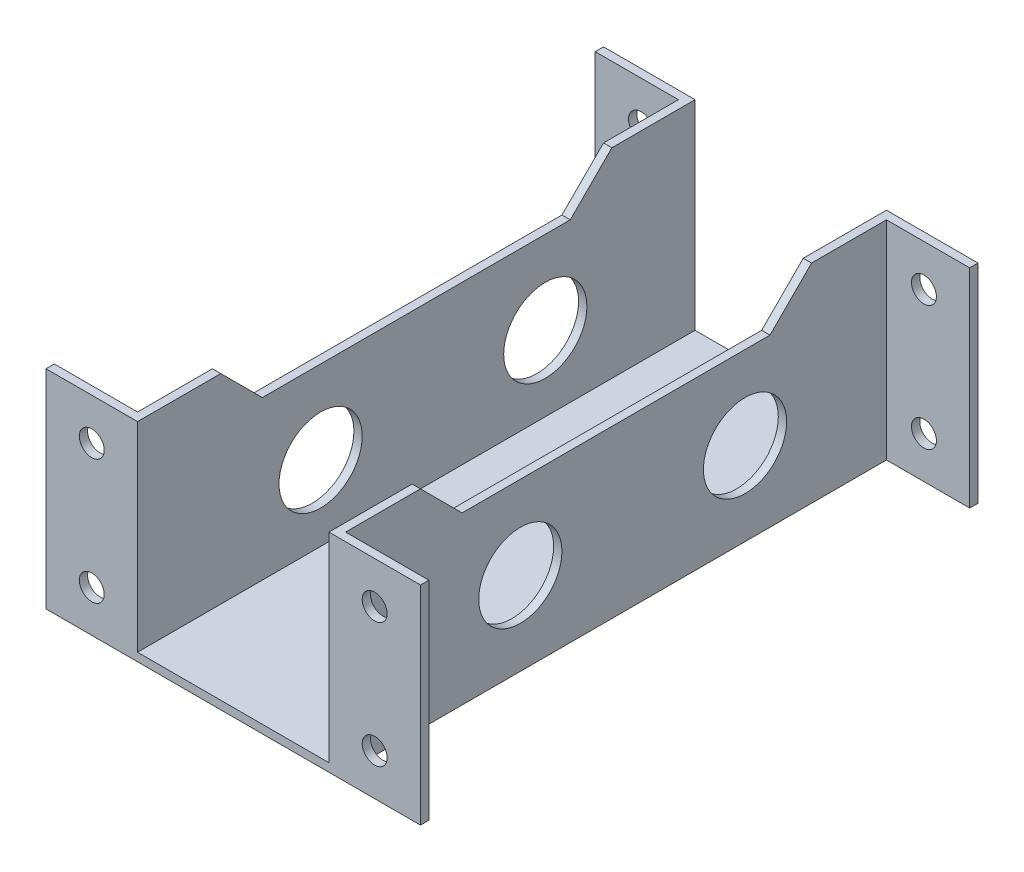
ISO-10303-21;
HEADER;
FILE_DESCRIPTION(('STEP AP214'),'2;1');
FILE_NAME('part.step','',(''),(''),'','','');
FILE_SCHEMA(('AUTOMOTIVE_DESIGN { 1 0 10303 214 1 1 1 1 }'));
ENDSEC;
DATA;
#1=APPLICATION_CONTEXT('core data for automotive mechanical design processes');
#2=APPLICATION_PROTOCOL_DEFINITION('international standard','automotive_design',2000,#1);
#3=PRODUCT_CONTEXT('',#1,'mechanical');
#4=PRODUCT('Part','Part','',(#3));
#5=PRODUCT_RELATED_PRODUCT_CATEGORY('part','',(#4));
#6=PRODUCT_DEFINITION_FORMATION('','',#4);
#7=PRODUCT_DEFINITION_CONTEXT('part definition',#1,'design');
#8=PRODUCT_DEFINITION('design','',#6,#7);
#9=PRODUCT_DEFINITION_SHAPE('','',#8);
#10=(LENGTH_UNIT() NAMED_UNIT(*) SI_UNIT(.MILLI.,.METRE.));
#11=(NAMED_UNIT(*) PLANE_ANGLE_UNIT() SI_UNIT($,.RADIAN.));
#12=(NAMED_UNIT(*) SI_UNIT($,.STERADIAN.) SOLID_ANGLE_UNIT());
#13=UNCERTAINTY_MEASURE_WITH_UNIT(LENGTH_MEASURE(1.E-05),#10,'distance_accuracy_value','');
#14=(GEOMETRIC_REPRESENTATION_CONTEXT(3) GLOBAL_UNCERTAINTY_ASSIGNED_CONTEXT((#13)) GLOBAL_UNIT_ASSIGNED_CONTEXT((#10,
#11,#12)) REPRESENTATION_CONTEXT('',''));
#15=CARTESIAN_POINT('',(0.,0.,0.));
#16=DIRECTION('',(0.,0.,1.));
#17=DIRECTION('',(1.,0.,0.));
#18=AXIS2_PLACEMENT_3D('',#15,#16,#17);
#19=CARTESIAN_POINT('',(0.,25.,0.));
#20=DIRECTION('',(0.,-1.,0.));
#21=DIRECTION('',(0.,0.,-1.));
#22=AXIS2_PLACEMENT_3D('',#19,#20,#21);
#23=PLANE('',#22);
#24=DIRECTION('',(0.,0.,-1.));
#25=VECTOR('',#24,1.);
#26=CARTESIAN_POINT('',(12.5,25.,-33.5));
#27=LINE('',#26,#25);
#28=CARTESIAN_POINT('',(12.5,25.,32.5));
#29=VERTEX_POINT('',#28);
#30=CARTESIAN_POINT('',(12.5,25.,23.5));
#31=VERTEX_POINT('',#30);
#32=EDGE_CURVE('E251',#29,#31,#27,.T.);
#33=ORIENTED_EDGE('',*,*,#32,.T.);
#34=DIRECTION('',(1.,0.,0.));
#35=VECTOR('',#34,1.);
#36=CARTESIAN_POINT('',(-22.500025,25.,23.5));
#37=LINE('',#36,#35);
#38=CARTESIAN_POINT('',(11.5,25.,23.5));
#39=VERTEX_POINT('',#38);
#40=EDGE_CURVE('E376',#39,#31,#37,.T.);
#41=ORIENTED_EDGE('',*,*,#40,.F.);
#42=DIRECTION('',(0.,0.,1.));
#43=VECTOR('',#42,1.);
#44=CARTESIAN_POINT('',(11.5,25.,-33.5));
#45=LINE('',#44,#43);
#46=CARTESIAN_POINT('',(11.5,25.,33.5));
#47=VERTEX_POINT('',#46);
#48=EDGE_CURVE('E492',#39,#47,#45,.T.);
#49=ORIENTED_EDGE('',*,*,#48,.T.);
#50=DIRECTION('',(1.,0.,0.));
#51=VECTOR('',#50,1.);
#52=CARTESIAN_POINT('',(12.5,25.,33.5));
#53=LINE('',#52,#51);
#54=CARTESIAN_POINT('',(22.5,25.,33.5));
#55=VERTEX_POINT('',#54);
#56=EDGE_CURVE('E360',#47,#55,#53,.T.);
#57=ORIENTED_EDGE('',*,*,#56,.T.);
#58=DIRECTION('',(0.,0.,1.));
#59=VECTOR('',#58,1.);
#60=CARTESIAN_POINT('',(22.5,25.,33.5));
#61=LINE('',#60,#59);
#62=CARTESIAN_POINT('',(22.5,25.,32.5));
#63=VERTEX_POINT('',#62);
#64=EDGE_CURVE('E278',#63,#55,#61,.T.);
#65=ORIENTED_EDGE('',*,*,#64,.F.);
#66=DIRECTION('',(-1.,0.,0.));
#67=VECTOR('',#66,1.);
#68=CARTESIAN_POINT('',(22.5,25.,32.5));
#69=LINE('',#68,#67);
#70=EDGE_CURVE('E274',#63,#29,#69,.T.);
#71=ORIENTED_EDGE('',*,*,#70,.T.);
#72=EDGE_LOOP('',(#33,#41,#49,#57,#65,#71));
#73=FACE_BOUND('',#72,.T.);
#74=ADVANCED_FACE('F35',(#73),#23,.F.);
#75=CARTESIAN_POINT('',(0.,25.,0.));
#76=DIRECTION('',(0.,1.,0.));
#77=DIRECTION('',(0.,0.,1.));
#78=AXIS2_PLACEMENT_3D('',#75,#76,#77);
#79=PLANE('',#78);
#80=DIRECTION('',(1.,0.,0.));
#81=VECTOR('',#80,1.);
#82=CARTESIAN_POINT('',(0.,25.,23.5));
#83=LINE('',#82,#81);
#84=CARTESIAN_POINT('',(-12.5,25.,23.5));
#85=VERTEX_POINT('',#84);
#86=CARTESIAN_POINT('',(-11.5,25.,23.5));
#87=VERTEX_POINT('',#86);
#88=EDGE_CURVE('E44',#85,#87,#83,.T.);
#89=ORIENTED_EDGE('',*,*,#88,.F.);
#90=DIRECTION('',(0.,0.,1.));
#91=VECTOR('',#90,1.);
#92=CARTESIAN_POINT('',(-12.5,25.,-33.5));
#93=LINE('',#92,#91);
#94=CARTESIAN_POINT('',(-12.5,25.,32.5));
#95=VERTEX_POINT('',#94);
#96=EDGE_CURVE('E223',#85,#95,#93,.T.);
#97=ORIENTED_EDGE('',*,*,#96,.T.);
#98=DIRECTION('',(1.,0.,0.));
#99=VECTOR('',#98,1.);
#100=CARTESIAN_POINT('',(-22.5,25.,32.5));
#101=LINE('',#100,#99);
#102=CARTESIAN_POINT('',(-22.5,25.,32.5));
#103=VERTEX_POINT('',#102);
#104=EDGE_CURVE('E318',#103,#95,#101,.T.);
#105=ORIENTED_EDGE('',*,*,#104,.F.);
#106=DIRECTION('',(0.,0.,-1.));
#107=VECTOR('',#106,1.);
#108=CARTESIAN_POINT('',(-22.5,25.,33.5));
#109=LINE('',#108,#107);
#110=CARTESIAN_POINT('',(-22.5,25.,33.5));
#111=VERTEX_POINT('',#110);
#112=EDGE_CURVE('E447',#111,#103,#109,.T.);
#113=ORIENTED_EDGE('',*,*,#112,.F.);
#114=DIRECTION('',(1.,0.,0.));
#115=VECTOR('',#114,1.);
#116=CARTESIAN_POINT('',(-12.5,25.,33.5));
#117=LINE('',#116,#115);
#118=CARTESIAN_POINT('',(-11.5,25.,33.5));
#119=VERTEX_POINT('',#118);
#120=EDGE_CURVE('E222',#111,#119,#117,.T.);
#121=ORIENTED_EDGE('',*,*,#120,.T.);
#122=DIRECTION('',(0.,0.,-1.));
#123=VECTOR('',#122,1.);
#124=CARTESIAN_POINT('',(-11.5,25.,-33.5));
#125=LINE('',#124,#123);
#126=EDGE_CURVE('E299',#119,#87,#125,.T.);
#127=ORIENTED_EDGE('',*,*,#126,.T.);
#128=EDGE_LOOP('',(#89,#97,#105,#113,#121,#127));
#129=FACE_BOUND('',#128,.T.);
#130=ADVANCED_FACE('F563',(#129),#79,.T.);
#131=CARTESIAN_POINT('',(-12.5,1.,33.5));
#132=DIRECTION('',(1.,0.,0.));
#133=DIRECTION('',(0.,0.,-1.));
#134=AXIS2_PLACEMENT_3D('',#131,#132,#133);
#135=PLANE('',#134);
#136=CARTESIAN_POINT('',(-12.5,10.,-15.5));
#137=DIRECTION('',(1.,0.,0.));
#138=DIRECTION('',(0.,0.,-1.));
#139=AXIS2_PLACEMENT_3D('',#136,#137,#138);
#140=CIRCLE('',#139,5.);
#141=CARTESIAN_POINT('',(-12.5,10.,-20.5));
#142=VERTEX_POINT('',#141);
#143=EDGE_CURVE('E539',#142,#142,#140,.T.);
#144=ORIENTED_EDGE('',*,*,#143,.T.);
#145=EDGE_LOOP('',(#144));
#146=FACE_BOUND('',#145,.T.);
#147=CARTESIAN_POINT('',(-12.5,10.,11.5));
#148=DIRECTION('',(1.,0.,0.));
#149=DIRECTION('',(0.,0.,-1.));
#150=AXIS2_PLACEMENT_3D('',#147,#148,#149);
#151=CIRCLE('',#150,5.);
#152=CARTESIAN_POINT('',(-12.5,10.,6.49999999999999));
#153=VERTEX_POINT('',#152);
#154=EDGE_CURVE('E521',#153,#153,#151,.T.);
#155=ORIENTED_EDGE('',*,*,#154,.T.);
#156=EDGE_LOOP('',(#155));
#157=FACE_BOUND('',#156,.T.);
#158=ORIENTED_EDGE('',*,*,#96,.F.);
#159=DIRECTION('',(0.,-0.707106781186549,-0.707106781186546));
#160=VECTOR('',#159,1.);
#161=CARTESIAN_POINT('',(-12.5,18.,16.5));
#162=LINE('',#161,#160);
#163=CARTESIAN_POINT('',(-12.5,20.,18.5));
#164=VERTEX_POINT('',#163);
#165=EDGE_CURVE('E386',#85,#164,#162,.T.);
#166=ORIENTED_EDGE('',*,*,#165,.T.);
#167=DIRECTION('',(0.,0.,-1.));
#168=VECTOR('',#167,1.);
#169=CARTESIAN_POINT('',(-12.5,20.,33.5));
#170=LINE('',#169,#168);
#171=CARTESIAN_POINT('',(-12.5,20.,-18.5));
#172=VERTEX_POINT('',#171);
#173=EDGE_CURVE('E214',#164,#172,#170,.T.);
#174=ORIENTED_EDGE('',*,*,#173,.T.);
#175=DIRECTION('',(0.,0.707106781186546,-0.707106781186549));
#176=VECTOR('',#175,1.);
#177=CARTESIAN_POINT('',(-12.5,-15.5,17.0000000000001));
#178=LINE('',#177,#176);
#179=CARTESIAN_POINT('',(-12.5,25.,-23.5));
#180=VERTEX_POINT('',#179);
#181=EDGE_CURVE('E200',#172,#180,#178,.T.);
#182=ORIENTED_EDGE('',*,*,#181,.T.);
#183=CARTESIAN_POINT('',(-12.5,25.,-32.5));
#184=VERTEX_POINT('',#183);
#185=EDGE_CURVE('E211',#184,#180,#93,.T.);
#186=ORIENTED_EDGE('',*,*,#185,.F.);
#187=DIRECTION('',(0.,1.,0.));
#188=VECTOR('',#187,1.);
#189=CARTESIAN_POINT('',(-12.5,25.,-32.5));
#190=LINE('',#189,#188);
#191=CARTESIAN_POINT('',(-12.5,0.,-32.5));
#192=VERTEX_POINT('',#191);
#193=EDGE_CURVE('E235',#192,#184,#190,.T.);
#194=ORIENTED_EDGE('',*,*,#193,.F.);
#195=DIRECTION('',(0.,0.,1.));
#196=VECTOR('',#195,1.);
#197=CARTESIAN_POINT('',(-12.5,0.,33.5));
#198=LINE('',#197,#196);
#199=CARTESIAN_POINT('',(-12.5,0.,32.5));
#200=VERTEX_POINT('',#199);
#201=EDGE_CURVE('E232',#192,#200,#198,.T.);
#202=ORIENTED_EDGE('',*,*,#201,.T.);
#203=DIRECTION('',(0.,-1.,0.));
#204=VECTOR('',#203,1.);
#205=CARTESIAN_POINT('',(-12.5,25.,32.5));
#206=LINE('',#205,#204);
#207=EDGE_CURVE('E448',#95,#200,#206,.T.);
#208=ORIENTED_EDGE('',*,*,#207,.F.);
#209=EDGE_LOOP('',(#158,#166,#174,#182,#186,#194,#202,#208));
#210=FACE_BOUND('',#209,.T.);
#211=ADVANCED_FACE('F210',(#146,#157,#210),#135,.F.);
#212=CARTESIAN_POINT('',(12.5,1.,33.5));
#213=DIRECTION('',(-1.,0.,0.));
#214=DIRECTION('',(0.,0.,1.));
#215=AXIS2_PLACEMENT_3D('',#212,#213,#214);
#216=PLANE('',#215);
#217=CARTESIAN_POINT('',(12.5,10.,-15.5));
#218=DIRECTION('',(1.,0.,0.));
#219=DIRECTION('',(0.,0.,-1.));
#220=AXIS2_PLACEMENT_3D('',#217,#218,#219);
#221=CIRCLE('',#220,5.);
#222=CARTESIAN_POINT('',(12.5,10.,-20.5));
#223=VERTEX_POINT('',#222);
#224=EDGE_CURVE('E545',#223,#223,#221,.T.);
#225=ORIENTED_EDGE('',*,*,#224,.F.);
#226=EDGE_LOOP('',(#225));
#227=FACE_BOUND('',#226,.T.);
#228=CARTESIAN_POINT('',(12.5,10.,11.5));
#229=DIRECTION('',(1.,0.,0.));
#230=DIRECTION('',(0.,0.,-1.));
#231=AXIS2_PLACEMENT_3D('',#228,#229,#230);
#232=CIRCLE('',#231,5.);
#233=CARTESIAN_POINT('',(12.5,10.,6.49999999999999));
#234=VERTEX_POINT('',#233);
#235=EDGE_CURVE('E535',#234,#234,#232,.T.);
#236=ORIENTED_EDGE('',*,*,#235,.F.);
#237=EDGE_LOOP('',(#236));
#238=FACE_BOUND('',#237,.T.);
#239=DIRECTION('',(0.,0.,1.));
#240=VECTOR('',#239,1.);
#241=CARTESIAN_POINT('',(12.5,20.,33.5));
#242=LINE('',#241,#240);
#243=CARTESIAN_POINT('',(12.5,20.,-18.5));
#244=VERTEX_POINT('',#243);
#245=CARTESIAN_POINT('',(12.5,20.,18.5));
#246=VERTEX_POINT('',#245);
#247=EDGE_CURVE('E382',#244,#246,#242,.T.);
#248=ORIENTED_EDGE('',*,*,#247,.T.);
#249=DIRECTION('',(0.,0.707106781186549,0.707106781186546));
#250=VECTOR('',#249,1.);
#251=CARTESIAN_POINT('',(12.5,18.,16.5));
#252=LINE('',#251,#250);
#253=EDGE_CURVE('E381',#246,#31,#252,.T.);
#254=ORIENTED_EDGE('',*,*,#253,.T.);
#255=ORIENTED_EDGE('',*,*,#32,.F.);
#256=DIRECTION('',(0.,1.,0.));
#257=VECTOR('',#256,1.);
#258=CARTESIAN_POINT('',(12.5,25.,32.5));
#259=LINE('',#258,#257);
#260=CARTESIAN_POINT('',(12.5,0.,32.5));
#261=VERTEX_POINT('',#260);
#262=EDGE_CURVE('E269',#261,#29,#259,.T.);
#263=ORIENTED_EDGE('',*,*,#262,.F.);
#264=DIRECTION('',(0.,0.,-1.));
#265=VECTOR('',#264,1.);
#266=CARTESIAN_POINT('',(12.5,0.,33.5));
#267=LINE('',#266,#265);
#268=CARTESIAN_POINT('',(12.5,0.,-32.5));
#269=VERTEX_POINT('',#268);
#270=EDGE_CURVE('E266',#261,#269,#267,.T.);
#271=ORIENTED_EDGE('',*,*,#270,.T.);
#272=DIRECTION('',(0.,-1.,0.));
#273=VECTOR('',#272,1.);
#274=CARTESIAN_POINT('',(12.5,25.,-32.5));
#275=LINE('',#274,#273);
#276=CARTESIAN_POINT('',(12.5,25.,-32.5));
#277=VERTEX_POINT('',#276);
#278=EDGE_CURVE('E330',#277,#269,#275,.T.);
#279=ORIENTED_EDGE('',*,*,#278,.F.);
#280=CARTESIAN_POINT('',(12.5,25.,-23.5));
#281=VERTEX_POINT('',#280);
#282=EDGE_CURVE('E249',#281,#277,#27,.T.);
#283=ORIENTED_EDGE('',*,*,#282,.F.);
#284=DIRECTION('',(0.,-0.707106781186546,0.707106781186549));
#285=VECTOR('',#284,1.);
#286=CARTESIAN_POINT('',(12.5,-15.5,17.0000000000001));
#287=LINE('',#286,#285);
#288=EDGE_CURVE('E52',#281,#244,#287,.T.);
#289=ORIENTED_EDGE('',*,*,#288,.T.);
#290=EDGE_LOOP('',(#248,#254,#255,#263,#271,#279,#283,#289));
#291=FACE_BOUND('',#290,.T.);
#292=ADVANCED_FACE('F37',(#227,#238,#291),#216,.F.);
#293=CARTESIAN_POINT('',(0.,1.,0.));
#294=DIRECTION('',(0.,-1.,0.));
#295=DIRECTION('',(0.,0.,-1.));
#296=AXIS2_PLACEMENT_3D('',#293,#294,#295);
#297=PLANE('',#296);
#298=CARTESIAN_POINT('',(0.,1.,-15.5));
#299=DIRECTION('',(0.,1.,0.));
#300=DIRECTION('',(0.,0.,1.));
#301=AXIS2_PLACEMENT_3D('',#298,#299,#300);
#302=CIRCLE('',#301,5.);
#303=CARTESIAN_POINT('',(0.,1.,-10.5));
#304=VERTEX_POINT('',#303);
#305=EDGE_CURVE('E438',#304,#304,#302,.T.);
#306=ORIENTED_EDGE('',*,*,#305,.F.);
#307=EDGE_LOOP('',(#306));
#308=FACE_BOUND('',#307,.T.);
#309=CARTESIAN_POINT('',(0.,1.,11.5));
#310=DIRECTION('',(0.,1.,0.));
#311=DIRECTION('',(0.,0.,1.));
#312=AXIS2_PLACEMENT_3D('',#309,#310,#311);
#313=CIRCLE('',#312,5.);
#314=CARTESIAN_POINT('',(0.,1.,16.5));
#315=VERTEX_POINT('',#314);
#316=EDGE_CURVE('E442',#315,#315,#313,.T.);
#317=ORIENTED_EDGE('',*,*,#316,.F.);
#318=EDGE_LOOP('',(#317));
#319=FACE_BOUND('',#318,.T.);
#320=DIRECTION('',(0.,0.,-1.));
#321=VECTOR('',#320,1.);
#322=CARTESIAN_POINT('',(-11.5,1.,-33.5));
#323=LINE('',#322,#321);
#324=CARTESIAN_POINT('',(-11.5,1.,33.5));
#325=VERTEX_POINT('',#324);
#326=CARTESIAN_POINT('',(-11.5,1.,-33.5));
#327=VERTEX_POINT('',#326);
#328=EDGE_CURVE('E227',#325,#327,#323,.T.);
#329=ORIENTED_EDGE('',*,*,#328,.F.);
#330=DIRECTION('',(1.,0.,0.));
#331=VECTOR('',#330,1.);
#332=CARTESIAN_POINT('',(-12.5,1.,33.5));
#333=LINE('',#332,#331);
#334=CARTESIAN_POINT('',(11.5,1.,33.5));
#335=VERTEX_POINT('',#334);
#336=EDGE_CURVE('E205',#325,#335,#333,.T.);
#337=ORIENTED_EDGE('',*,*,#336,.T.);
#338=DIRECTION('',(0.,0.,1.));
#339=VECTOR('',#338,1.);
#340=CARTESIAN_POINT('',(11.5,1.,-33.5));
#341=LINE('',#340,#339);
#342=CARTESIAN_POINT('',(11.5,1.,-33.5));
#343=VERTEX_POINT('',#342);
#344=EDGE_CURVE('E252',#343,#335,#341,.T.);
#345=ORIENTED_EDGE('',*,*,#344,.F.);
#346=DIRECTION('',(-1.,0.,0.));
#347=VECTOR('',#346,1.);
#348=CARTESIAN_POINT('',(-12.5,1.,-33.5));
#349=LINE('',#348,#347);
#350=EDGE_CURVE('E369',#343,#327,#349,.T.);
#351=ORIENTED_EDGE('',*,*,#350,.T.);
#352=EDGE_LOOP('',(#329,#337,#345,#351));
#353=FACE_BOUND('',#352,.T.);
#354=ADVANCED_FACE('F569',(#308,#319,#353),#297,.F.);
#355=CARTESIAN_POINT('',(-12.5,1.,-33.5));
#356=DIRECTION('',(0.,0.,1.));
#357=DIRECTION('',(1.,0.,0.));
#358=AXIS2_PLACEMENT_3D('',#355,#356,#357);
#359=PLANE('',#358);
#360=CARTESIAN_POINT('',(17.,20.,-33.5));
#361=DIRECTION('',(0.,0.,1.));
#362=DIRECTION('',(1.,0.,0.));
#363=AXIS2_PLACEMENT_3D('',#360,#361,#362);
#364=CIRCLE('',#363,1.5);
#365=CARTESIAN_POINT('',(18.5,20.,-33.5));
#366=VERTEX_POINT('',#365);
#367=EDGE_CURVE('E405',#366,#366,#364,.T.);
#368=ORIENTED_EDGE('',*,*,#367,.T.);
#369=EDGE_LOOP('',(#368));
#370=FACE_BOUND('',#369,.T.);
#371=CARTESIAN_POINT('',(17.,5.,-33.5));
#372=DIRECTION('',(0.,0.,1.));
#373=DIRECTION('',(1.,0.,0.));
#374=AXIS2_PLACEMENT_3D('',#371,#372,#373);
#375=CIRCLE('',#374,1.5);
#376=CARTESIAN_POINT('',(18.5,5.,-33.5));
#377=VERTEX_POINT('',#376);
#378=EDGE_CURVE('E415',#377,#377,#375,.T.);
#379=ORIENTED_EDGE('',*,*,#378,.T.);
#380=EDGE_LOOP('',(#379));
#381=FACE_BOUND('',#380,.T.);
#382=CARTESIAN_POINT('',(-17.,20.,-33.5));
#383=DIRECTION('',(0.,0.,1.));
#384=DIRECTION('',(1.,0.,0.));
#385=AXIS2_PLACEMENT_3D('',#382,#383,#384);
#386=CIRCLE('',#385,1.5);
#387=CARTESIAN_POINT('',(-15.5,20.,-33.5));
#388=VERTEX_POINT('',#387);
#389=EDGE_CURVE('E425',#388,#388,#386,.T.);
#390=ORIENTED_EDGE('',*,*,#389,.T.);
#391=EDGE_LOOP('',(#390));
#392=FACE_BOUND('',#391,.T.);
#393=CARTESIAN_POINT('',(-17.,5.,-33.5));
#394=DIRECTION('',(0.,0.,1.));
#395=DIRECTION('',(1.,0.,0.));
#396=AXIS2_PLACEMENT_3D('',#393,#394,#395);
#397=CIRCLE('',#396,1.5);
#398=CARTESIAN_POINT('',(-15.5,5.,-33.5));
#399=VERTEX_POINT('',#398);
#400=EDGE_CURVE('E435',#399,#399,#397,.T.);
#401=ORIENTED_EDGE('',*,*,#400,.T.);
#402=EDGE_LOOP('',(#401));
#403=FACE_BOUND('',#402,.T.);
#404=DIRECTION('',(-1.,0.,0.));
#405=VECTOR('',#404,1.);
#406=CARTESIAN_POINT('',(-12.5,0.,-33.5));
#407=LINE('',#406,#405);
#408=CARTESIAN_POINT('',(22.5,0.,-33.5));
#409=VERTEX_POINT('',#408);
#410=CARTESIAN_POINT('',(-22.5,0.,-33.5));
#411=VERTEX_POINT('',#410);
#412=EDGE_CURVE('E311',#409,#411,#407,.T.);
#413=ORIENTED_EDGE('',*,*,#412,.T.);
#414=DIRECTION('',(0.,-1.,0.));
#415=VECTOR('',#414,1.);
#416=CARTESIAN_POINT('',(-22.5,25.,-33.5));
#417=LINE('',#416,#415);
#418=CARTESIAN_POINT('',(-22.5,25.,-33.5));
#419=VERTEX_POINT('',#418);
#420=EDGE_CURVE('E309',#419,#411,#417,.T.);
#421=ORIENTED_EDGE('',*,*,#420,.F.);
#422=DIRECTION('',(-1.,0.,0.));
#423=VECTOR('',#422,1.);
#424=CARTESIAN_POINT('',(-12.5,25.,-33.5));
#425=LINE('',#424,#423);
#426=CARTESIAN_POINT('',(-11.5,25.,-33.5));
#427=VERTEX_POINT('',#426);
#428=EDGE_CURVE('E294',#427,#419,#425,.T.);
#429=ORIENTED_EDGE('',*,*,#428,.F.);
#430=DIRECTION('',(0.,-1.,0.));
#431=VECTOR('',#430,1.);
#432=CARTESIAN_POINT('',(-11.5,25.,-33.5));
#433=LINE('',#432,#431);
#434=EDGE_CURVE('E295',#427,#327,#433,.T.);
#435=ORIENTED_EDGE('',*,*,#434,.T.);
#436=ORIENTED_EDGE('',*,*,#350,.F.);
#437=DIRECTION('',(0.,-1.,0.));
#438=VECTOR('',#437,1.);
#439=CARTESIAN_POINT('',(11.5,25.,-33.5));
#440=LINE('',#439,#438);
#441=CARTESIAN_POINT('',(11.5,25.,-33.5));
#442=VERTEX_POINT('',#441);
#443=EDGE_CURVE('E469',#442,#343,#440,.T.);
#444=ORIENTED_EDGE('',*,*,#443,.F.);
#445=DIRECTION('',(-1.,0.,0.));
#446=VECTOR('',#445,1.);
#447=CARTESIAN_POINT('',(12.5,25.,-33.5));
#448=LINE('',#447,#446);
#449=CARTESIAN_POINT('',(22.5,25.,-33.5));
#450=VERTEX_POINT('',#449);
#451=EDGE_CURVE('E259',#450,#442,#448,.T.);
#452=ORIENTED_EDGE('',*,*,#451,.F.);
#453=DIRECTION('',(0.,1.,0.));
#454=VECTOR('',#453,1.);
#455=CARTESIAN_POINT('',(22.5,25.,-33.5));
#456=LINE('',#455,#454);
#457=EDGE_CURVE('E326',#409,#450,#456,.T.);
#458=ORIENTED_EDGE('',*,*,#457,.F.);
#459=EDGE_LOOP('',(#413,#421,#429,#435,#436,#444,#452,#458));
#460=FACE_BOUND('',#459,.T.);
#461=ADVANCED_FACE('F307',(#370,#381,#392,#403,#460),#359,.F.);
#462=CARTESIAN_POINT('',(-12.5,1.,33.5));
#463=DIRECTION('',(0.,0.,-1.));
#464=DIRECTION('',(-1.,0.,0.));
#465=AXIS2_PLACEMENT_3D('',#462,#463,#464);
#466=PLANE('',#465);
#467=CARTESIAN_POINT('',(17.,20.,33.5));
#468=DIRECTION('',(0.,0.,1.));
#469=DIRECTION('',(1.,0.,0.));
#470=AXIS2_PLACEMENT_3D('',#467,#468,#469);
#471=CIRCLE('',#470,1.5);
#472=CARTESIAN_POINT('',(18.5,20.,33.5));
#473=VERTEX_POINT('',#472);
#474=EDGE_CURVE('E399',#473,#473,#471,.T.);
#475=ORIENTED_EDGE('',*,*,#474,.F.);
#476=EDGE_LOOP('',(#475));
#477=FACE_BOUND('',#476,.T.);
#478=CARTESIAN_POINT('',(17.,5.,33.5));
#479=DIRECTION('',(0.,0.,1.));
#480=DIRECTION('',(1.,0.,0.));
#481=AXIS2_PLACEMENT_3D('',#478,#479,#480);
#482=CIRCLE('',#481,1.5);
#483=CARTESIAN_POINT('',(18.5,5.,33.5));
#484=VERTEX_POINT('',#483);
#485=EDGE_CURVE('E408',#484,#484,#482,.T.);
#486=ORIENTED_EDGE('',*,*,#485,.F.);
#487=EDGE_LOOP('',(#486));
#488=FACE_BOUND('',#487,.T.);
#489=CARTESIAN_POINT('',(-17.,20.,33.5));
#490=DIRECTION('',(0.,0.,1.));
#491=DIRECTION('',(1.,0.,0.));
#492=AXIS2_PLACEMENT_3D('',#489,#490,#491);
#493=CIRCLE('',#492,1.5);
#494=CARTESIAN_POINT('',(-15.5,20.,33.5));
#495=VERTEX_POINT('',#494);
#496=EDGE_CURVE('E418',#495,#495,#493,.T.);
#497=ORIENTED_EDGE('',*,*,#496,.F.);
#498=EDGE_LOOP('',(#497));
#499=FACE_BOUND('',#498,.T.);
#500=CARTESIAN_POINT('',(-17.,5.,33.5));
#501=DIRECTION('',(0.,0.,1.));
#502=DIRECTION('',(1.,0.,0.));
#503=AXIS2_PLACEMENT_3D('',#500,#501,#502);
#504=CIRCLE('',#503,1.5);
#505=CARTESIAN_POINT('',(-15.5,5.,33.5));
#506=VERTEX_POINT('',#505);
#507=EDGE_CURVE('E428',#506,#506,#504,.T.);
#508=ORIENTED_EDGE('',*,*,#507,.F.);
#509=EDGE_LOOP('',(#508));
#510=FACE_BOUND('',#509,.T.);
#511=DIRECTION('',(1.,0.,0.));
#512=VECTOR('',#511,1.);
#513=CARTESIAN_POINT('',(-12.5,0.,33.5));
#514=LINE('',#513,#512);
#515=CARTESIAN_POINT('',(-22.5,0.,33.5));
#516=VERTEX_POINT('',#515);
#517=CARTESIAN_POINT('',(22.5,0.,33.5));
#518=VERTEX_POINT('',#517);
#519=EDGE_CURVE('E362',#516,#518,#514,.T.);
#520=ORIENTED_EDGE('',*,*,#519,.T.);
#521=DIRECTION('',(0.,-1.,0.));
#522=VECTOR('',#521,1.);
#523=CARTESIAN_POINT('',(22.5,25.,33.5));
#524=LINE('',#523,#522);
#525=EDGE_CURVE('E272',#55,#518,#524,.T.);
#526=ORIENTED_EDGE('',*,*,#525,.F.);
#527=ORIENTED_EDGE('',*,*,#56,.F.);
#528=DIRECTION('',(0.,-1.,0.));
#529=VECTOR('',#528,1.);
#530=CARTESIAN_POINT('',(11.5,25.,33.5));
#531=LINE('',#530,#529);
#532=EDGE_CURVE('E487',#47,#335,#531,.T.);
#533=ORIENTED_EDGE('',*,*,#532,.T.);
#534=ORIENTED_EDGE('',*,*,#336,.F.);
#535=DIRECTION('',(0.,-1.,0.));
#536=VECTOR('',#535,1.);
#537=CARTESIAN_POINT('',(-11.5,25.,33.5));
#538=LINE('',#537,#536);
#539=EDGE_CURVE('E257',#119,#325,#538,.T.);
#540=ORIENTED_EDGE('',*,*,#539,.F.);
#541=ORIENTED_EDGE('',*,*,#120,.F.);
#542=DIRECTION('',(0.,1.,0.));
#543=VECTOR('',#542,1.);
#544=CARTESIAN_POINT('',(-22.5,25.,33.5));
#545=LINE('',#544,#543);
#546=EDGE_CURVE('E365',#516,#111,#545,.T.);
#547=ORIENTED_EDGE('',*,*,#546,.F.);
#548=EDGE_LOOP('',(#520,#526,#527,#533,#534,#540,#541,#547));
#549=FACE_BOUND('',#548,.T.);
#550=ADVANCED_FACE('F358',(#477,#488,#499,#510,#549),#466,.F.);
#551=CARTESIAN_POINT('',(0.,0.,0.));
#552=DIRECTION('',(0.,-1.,0.));
#553=DIRECTION('',(0.,0.,-1.));
#554=AXIS2_PLACEMENT_3D('',#551,#552,#553);
#555=PLANE('',#554);
#556=CARTESIAN_POINT('',(0.,0.,-15.5));
#557=DIRECTION('',(0.,-1.,0.));
#558=DIRECTION('',(0.,0.,-1.));
#559=AXIS2_PLACEMENT_3D('',#556,#557,#558);
#560=CIRCLE('',#559,5.);
#561=CARTESIAN_POINT('',(0.,0.,-20.5));
#562=VERTEX_POINT('',#561);
#563=EDGE_CURVE('E441',#562,#562,#560,.T.);
#564=ORIENTED_EDGE('',*,*,#563,.F.);
#565=EDGE_LOOP('',(#564));
#566=FACE_BOUND('',#565,.T.);
#567=CARTESIAN_POINT('',(0.,0.,11.5));
#568=DIRECTION('',(0.,-1.,0.));
#569=DIRECTION('',(0.,0.,-1.));
#570=AXIS2_PLACEMENT_3D('',#567,#568,#569);
#571=CIRCLE('',#570,5.);
#572=CARTESIAN_POINT('',(0.,0.,6.49999999999999));
#573=VERTEX_POINT('',#572);
#574=EDGE_CURVE('E445',#573,#573,#571,.T.);
#575=ORIENTED_EDGE('',*,*,#574,.F.);
#576=EDGE_LOOP('',(#575));
#577=FACE_BOUND('',#576,.T.);
#578=ORIENTED_EDGE('',*,*,#270,.F.);
#579=DIRECTION('',(-1.,0.,0.));
#580=VECTOR('',#579,1.);
#581=CARTESIAN_POINT('',(22.5,0.,32.5));
#582=LINE('',#581,#580);
#583=CARTESIAN_POINT('',(22.5,0.,32.5));
#584=VERTEX_POINT('',#583);
#585=EDGE_CURVE('E277',#584,#261,#582,.T.);
#586=ORIENTED_EDGE('',*,*,#585,.F.);
#587=DIRECTION('',(0.,0.,-1.));
#588=VECTOR('',#587,1.);
#589=CARTESIAN_POINT('',(22.5,0.,33.5));
#590=LINE('',#589,#588);
#591=EDGE_CURVE('E346',#518,#584,#590,.T.);
#592=ORIENTED_EDGE('',*,*,#591,.F.);
#593=ORIENTED_EDGE('',*,*,#519,.F.);
#594=DIRECTION('',(0.,0.,1.));
#595=VECTOR('',#594,1.);
#596=CARTESIAN_POINT('',(-22.5,0.,33.5));
#597=LINE('',#596,#595);
#598=CARTESIAN_POINT('',(-22.5,0.,32.5));
#599=VERTEX_POINT('',#598);
#600=EDGE_CURVE('E452',#599,#516,#597,.T.);
#601=ORIENTED_EDGE('',*,*,#600,.F.);
#602=DIRECTION('',(1.,0.,0.));
#603=VECTOR('',#602,1.);
#604=CARTESIAN_POINT('',(-22.5,0.,32.5));
#605=LINE('',#604,#603);
#606=EDGE_CURVE('E454',#599,#200,#605,.T.);
#607=ORIENTED_EDGE('',*,*,#606,.T.);
#608=ORIENTED_EDGE('',*,*,#201,.F.);
#609=DIRECTION('',(1.,0.,0.));
#610=VECTOR('',#609,1.);
#611=CARTESIAN_POINT('',(-22.5,0.,-32.5));
#612=LINE('',#611,#610);
#613=CARTESIAN_POINT('',(-22.5,0.,-32.5));
#614=VERTEX_POINT('',#613);
#615=EDGE_CURVE('E339',#614,#192,#612,.T.);
#616=ORIENTED_EDGE('',*,*,#615,.F.);
#617=DIRECTION('',(0.,0.,1.));
#618=VECTOR('',#617,1.);
#619=CARTESIAN_POINT('',(-22.5,0.,-33.5));
#620=LINE('',#619,#618);
#621=EDGE_CURVE('E314',#411,#614,#620,.T.);
#622=ORIENTED_EDGE('',*,*,#621,.F.);
#623=ORIENTED_EDGE('',*,*,#412,.F.);
#624=DIRECTION('',(0.,0.,-1.));
#625=VECTOR('',#624,1.);
#626=CARTESIAN_POINT('',(22.5,0.,-33.5));
#627=LINE('',#626,#625);
#628=CARTESIAN_POINT('',(22.5,0.,-32.5));
#629=VERTEX_POINT('',#628);
#630=EDGE_CURVE('E334',#629,#409,#627,.T.);
#631=ORIENTED_EDGE('',*,*,#630,.F.);
#632=DIRECTION('',(-1.,0.,0.));
#633=VECTOR('',#632,1.);
#634=CARTESIAN_POINT('',(22.5,0.,-32.5));
#635=LINE('',#634,#633);
#636=EDGE_CURVE('E337',#629,#269,#635,.T.);
#637=ORIENTED_EDGE('',*,*,#636,.T.);
#638=EDGE_LOOP('',(#578,#586,#592,#593,#601,#607,#608,#616,#622,#623,#631,#637));
#639=FACE_BOUND('',#638,.T.);
#640=ADVANCED_FACE('F372',(#566,#577,#639),#555,.T.);
#641=CARTESIAN_POINT('',(11.5,25.,-33.5));
#642=DIRECTION('',(1.,0.,0.));
#643=DIRECTION('',(0.,0.,-1.));
#644=AXIS2_PLACEMENT_3D('',#641,#642,#643);
#645=PLANE('',#644);
#646=CARTESIAN_POINT('',(11.5,10.,-15.5));
#647=DIRECTION('',(1.,0.,0.));
#648=DIRECTION('',(0.,0.,-1.));
#649=AXIS2_PLACEMENT_3D('',#646,#647,#648);
#650=CIRCLE('',#649,5.);
#651=CARTESIAN_POINT('',(11.5,10.,-20.5));
#652=VERTEX_POINT('',#651);
#653=EDGE_CURVE('E542',#652,#652,#650,.T.);
#654=ORIENTED_EDGE('',*,*,#653,.T.);
#655=EDGE_LOOP('',(#654));
#656=FACE_BOUND('',#655,.T.);
#657=CARTESIAN_POINT('',(11.5,10.,11.5));
#658=DIRECTION('',(1.,0.,0.));
#659=DIRECTION('',(0.,0.,-1.));
#660=AXIS2_PLACEMENT_3D('',#657,#658,#659);
#661=CIRCLE('',#660,5.);
#662=CARTESIAN_POINT('',(11.5,10.,6.49999999999999));
#663=VERTEX_POINT('',#662);
#664=EDGE_CURVE('E528',#663,#663,#661,.T.);
#665=ORIENTED_EDGE('',*,*,#664,.T.);
#666=EDGE_LOOP('',(#665));
#667=FACE_BOUND('',#666,.T.);
#668=ORIENTED_EDGE('',*,*,#48,.F.);
#669=DIRECTION('',(0.,-0.707106781186549,-0.707106781186546));
#670=VECTOR('',#669,1.);
#671=CARTESIAN_POINT('',(11.5,-3.50000000000001,-4.99999999999991));
#672=LINE('',#671,#670);
#673=CARTESIAN_POINT('',(11.5,20.,18.5));
#674=VERTEX_POINT('',#673);
#675=EDGE_CURVE('E387',#39,#674,#672,.T.);
#676=ORIENTED_EDGE('',*,*,#675,.T.);
#677=DIRECTION('',(0.,0.,-1.));
#678=VECTOR('',#677,1.);
#679=CARTESIAN_POINT('',(11.5,20.,-33.5));
#680=LINE('',#679,#678);
#681=CARTESIAN_POINT('',(11.5,20.,-18.5));
#682=VERTEX_POINT('',#681);
#683=EDGE_CURVE('E389',#674,#682,#680,.T.);
#684=ORIENTED_EDGE('',*,*,#683,.T.);
#685=DIRECTION('',(0.,0.707106781186546,-0.707106781186549));
#686=VECTOR('',#685,1.);
#687=CARTESIAN_POINT('',(11.5,30.,-28.5));
#688=LINE('',#687,#686);
#689=CARTESIAN_POINT('',(11.5,25.,-23.5));
#690=VERTEX_POINT('',#689);
#691=EDGE_CURVE('E503',#682,#690,#688,.T.);
#692=ORIENTED_EDGE('',*,*,#691,.T.);
#693=EDGE_CURVE('E490',#442,#690,#45,.T.);
#694=ORIENTED_EDGE('',*,*,#693,.F.);
#695=ORIENTED_EDGE('',*,*,#443,.T.);
#696=ORIENTED_EDGE('',*,*,#344,.T.);
#697=ORIENTED_EDGE('',*,*,#532,.F.);
#698=EDGE_LOOP('',(#668,#676,#684,#692,#694,#695,#696,#697));
#699=FACE_BOUND('',#698,.T.);
#700=ADVANCED_FACE('F502',(#656,#667,#699),#645,.F.);
#701=ORIENTED_EDGE('',*,*,#693,.T.);
#702=DIRECTION('',(1.,0.,0.));
#703=VECTOR('',#702,1.);
#704=CARTESIAN_POINT('',(-22.500025,25.,-23.5));
#705=LINE('',#704,#703);
#706=EDGE_CURVE('E524',#690,#281,#705,.T.);
#707=ORIENTED_EDGE('',*,*,#706,.T.);
#708=ORIENTED_EDGE('',*,*,#282,.T.);
#709=DIRECTION('',(-1.,0.,0.));
#710=VECTOR('',#709,1.);
#711=CARTESIAN_POINT('',(22.5,25.,-32.5));
#712=LINE('',#711,#710);
#713=CARTESIAN_POINT('',(22.5,25.,-32.5));
#714=VERTEX_POINT('',#713);
#715=EDGE_CURVE('E273',#714,#277,#712,.T.);
#716=ORIENTED_EDGE('',*,*,#715,.F.);
#717=DIRECTION('',(0.,0.,1.));
#718=VECTOR('',#717,1.);
#719=CARTESIAN_POINT('',(22.5,25.,-33.5));
#720=LINE('',#719,#718);
#721=EDGE_CURVE('E329',#450,#714,#720,.T.);
#722=ORIENTED_EDGE('',*,*,#721,.F.);
#723=ORIENTED_EDGE('',*,*,#451,.T.);
#724=EDGE_LOOP('',(#701,#707,#708,#716,#722,#723));
#725=FACE_BOUND('',#724,.T.);
#726=ADVANCED_FACE('F497',(#725),#23,.F.);
#727=CARTESIAN_POINT('',(-11.5,25.,-33.5));
#728=DIRECTION('',(-1.,0.,0.));
#729=DIRECTION('',(0.,0.,1.));
#730=AXIS2_PLACEMENT_3D('',#727,#728,#729);
#731=PLANE('',#730);
#732=CARTESIAN_POINT('',(-11.5,10.,-15.5));
#733=DIRECTION('',(-1.,0.,0.));
#734=DIRECTION('',(0.,0.,1.));
#735=AXIS2_PLACEMENT_3D('',#732,#733,#734);
#736=CIRCLE('',#735,5.);
#737=CARTESIAN_POINT('',(-11.5,10.,-10.5));
#738=VERTEX_POINT('',#737);
#739=EDGE_CURVE('E39',#738,#738,#736,.T.);
#740=ORIENTED_EDGE('',*,*,#739,.T.);
#741=EDGE_LOOP('',(#740));
#742=FACE_BOUND('',#741,.T.);
#743=CARTESIAN_POINT('',(-11.5,10.,11.5));
#744=DIRECTION('',(-1.,0.,0.));
#745=DIRECTION('',(0.,0.,1.));
#746=AXIS2_PLACEMENT_3D('',#743,#744,#745);
#747=CIRCLE('',#746,5.);
#748=CARTESIAN_POINT('',(-11.5,10.,16.5));
#749=VERTEX_POINT('',#748);
#750=EDGE_CURVE('E253',#749,#749,#747,.T.);
#751=ORIENTED_EDGE('',*,*,#750,.T.);
#752=EDGE_LOOP('',(#751));
#753=FACE_BOUND('',#752,.T.);
#754=DIRECTION('',(0.,0.,1.));
#755=VECTOR('',#754,1.);
#756=CARTESIAN_POINT('',(-11.5,20.,-33.5));
#757=LINE('',#756,#755);
#758=CARTESIAN_POINT('',(-11.5,20.,-18.5));
#759=VERTEX_POINT('',#758);
#760=CARTESIAN_POINT('',(-11.5,20.,18.5));
#761=VERTEX_POINT('',#760);
#762=EDGE_CURVE('E11',#759,#761,#757,.T.);
#763=ORIENTED_EDGE('',*,*,#762,.T.);
#764=DIRECTION('',(0.,0.707106781186549,0.707106781186546));
#765=VECTOR('',#764,1.);
#766=CARTESIAN_POINT('',(-11.5,-3.50000000000001,-4.99999999999991));
#767=LINE('',#766,#765);
#768=EDGE_CURVE('E215',#761,#87,#767,.T.);
#769=ORIENTED_EDGE('',*,*,#768,.T.);
#770=ORIENTED_EDGE('',*,*,#126,.F.);
#771=ORIENTED_EDGE('',*,*,#539,.T.);
#772=ORIENTED_EDGE('',*,*,#328,.T.);
#773=ORIENTED_EDGE('',*,*,#434,.F.);
#774=CARTESIAN_POINT('',(-11.5,25.,-23.5));
#775=VERTEX_POINT('',#774);
#776=EDGE_CURVE('E225',#775,#427,#125,.T.);
#777=ORIENTED_EDGE('',*,*,#776,.F.);
#778=DIRECTION('',(0.,-0.707106781186546,0.707106781186549));
#779=VECTOR('',#778,1.);
#780=CARTESIAN_POINT('',(-11.5,30.,-28.5));
#781=LINE('',#780,#779);
#782=EDGE_CURVE('E60',#775,#759,#781,.T.);
#783=ORIENTED_EDGE('',*,*,#782,.T.);
#784=EDGE_LOOP('',(#763,#769,#770,#771,#772,#773,#777,#783));
#785=FACE_BOUND('',#784,.T.);
#786=ADVANCED_FACE('F305',(#742,#753,#785),#731,.F.);
#787=DIRECTION('',(-1.,0.,0.));
#788=VECTOR('',#787,1.);
#789=CARTESIAN_POINT('',(0.,25.,-23.5));
#790=LINE('',#789,#788);
#791=EDGE_CURVE('E197',#775,#180,#790,.T.);
#792=ORIENTED_EDGE('',*,*,#791,.F.);
#793=ORIENTED_EDGE('',*,*,#776,.T.);
#794=ORIENTED_EDGE('',*,*,#428,.T.);
#795=DIRECTION('',(0.,0.,-1.));
#796=VECTOR('',#795,1.);
#797=CARTESIAN_POINT('',(-22.5,25.,-33.5));
#798=LINE('',#797,#796);
#799=CARTESIAN_POINT('',(-22.5,25.,-32.5));
#800=VERTEX_POINT('',#799);
#801=EDGE_CURVE('E323',#800,#419,#798,.T.);
#802=ORIENTED_EDGE('',*,*,#801,.F.);
#803=DIRECTION('',(1.,0.,0.));
#804=VECTOR('',#803,1.);
#805=CARTESIAN_POINT('',(-22.5,25.,-32.5));
#806=LINE('',#805,#804);
#807=EDGE_CURVE('E221',#800,#184,#806,.T.);
#808=ORIENTED_EDGE('',*,*,#807,.T.);
#809=ORIENTED_EDGE('',*,*,#185,.T.);
#810=EDGE_LOOP('',(#792,#793,#794,#802,#808,#809));
#811=FACE_BOUND('',#810,.T.);
#812=ADVANCED_FACE('F218',(#811),#79,.T.);
#813=CARTESIAN_POINT('',(22.5,25.,32.5));
#814=DIRECTION('',(0.,0.,1.));
#815=DIRECTION('',(1.,0.,0.));
#816=AXIS2_PLACEMENT_3D('',#813,#814,#815);
#817=PLANE('',#816);
#818=CARTESIAN_POINT('',(17.,20.,32.5));
#819=DIRECTION('',(0.,0.,1.));
#820=DIRECTION('',(1.,0.,0.));
#821=AXIS2_PLACEMENT_3D('',#818,#819,#820);
#822=CIRCLE('',#821,1.5);
#823=CARTESIAN_POINT('',(18.5,20.,32.5));
#824=VERTEX_POINT('',#823);
#825=EDGE_CURVE('E402',#824,#824,#822,.T.);
#826=ORIENTED_EDGE('',*,*,#825,.T.);
#827=EDGE_LOOP('',(#826));
#828=FACE_BOUND('',#827,.T.);
#829=CARTESIAN_POINT('',(17.,5.,32.5));
#830=DIRECTION('',(0.,0.,1.));
#831=DIRECTION('',(1.,0.,0.));
#832=AXIS2_PLACEMENT_3D('',#829,#830,#831);
#833=CIRCLE('',#832,1.5);
#834=CARTESIAN_POINT('',(18.5,5.,32.5));
#835=VERTEX_POINT('',#834);
#836=EDGE_CURVE('E412',#835,#835,#833,.T.);
#837=ORIENTED_EDGE('',*,*,#836,.T.);
#838=EDGE_LOOP('',(#837));
#839=FACE_BOUND('',#838,.T.);
#840=ORIENTED_EDGE('',*,*,#262,.T.);
#841=ORIENTED_EDGE('',*,*,#70,.F.);
#842=DIRECTION('',(0.,1.,0.));
#843=VECTOR('',#842,1.);
#844=CARTESIAN_POINT('',(22.5,25.,32.5));
#845=LINE('',#844,#843);
#846=EDGE_CURVE('E348',#584,#63,#845,.T.);
#847=ORIENTED_EDGE('',*,*,#846,.F.);
#848=ORIENTED_EDGE('',*,*,#585,.T.);
#849=EDGE_LOOP('',(#840,#841,#847,#848));
#850=FACE_BOUND('',#849,.T.);
#851=ADVANCED_FACE('F374',(#828,#839,#850),#817,.F.);
#852=CARTESIAN_POINT('',(22.5,0.,0.));
#853=DIRECTION('',(1.,0.,0.));
#854=DIRECTION('',(0.,0.,-1.));
#855=AXIS2_PLACEMENT_3D('',#852,#853,#854);
#856=PLANE('',#855);
#857=ORIENTED_EDGE('',*,*,#525,.T.);
#858=ORIENTED_EDGE('',*,*,#591,.T.);
#859=ORIENTED_EDGE('',*,*,#846,.T.);
#860=ORIENTED_EDGE('',*,*,#64,.T.);
#861=EDGE_LOOP('',(#857,#858,#859,#860));
#862=FACE_BOUND('',#861,.T.);
#863=ADVANCED_FACE('F353',(#862),#856,.T.);
#864=CARTESIAN_POINT('',(22.5,25.,-32.5));
#865=DIRECTION('',(0.,0.,-1.));
#866=DIRECTION('',(0.,1.,0.));
#867=AXIS2_PLACEMENT_3D('',#864,#865,#866);
#868=PLANE('',#867);
#869=CARTESIAN_POINT('',(17.,20.,-32.5));
#870=DIRECTION('',(0.,0.,-1.));
#871=DIRECTION('',(0.,1.,0.));
#872=AXIS2_PLACEMENT_3D('',#869,#870,#871);
#873=CIRCLE('',#872,1.5);
#874=CARTESIAN_POINT('',(17.,21.5,-32.5));
#875=VERTEX_POINT('',#874);
#876=EDGE_CURVE('E245',#875,#875,#873,.T.);
#877=ORIENTED_EDGE('',*,*,#876,.T.);
#878=EDGE_LOOP('',(#877));
#879=FACE_BOUND('',#878,.T.);
#880=CARTESIAN_POINT('',(17.,5.,-32.5));
#881=DIRECTION('',(0.,0.,-1.));
#882=DIRECTION('',(0.,1.,0.));
#883=AXIS2_PLACEMENT_3D('',#880,#881,#882);
#884=CIRCLE('',#883,1.5);
#885=CARTESIAN_POINT('',(17.,6.5,-32.5));
#886=VERTEX_POINT('',#885);
#887=EDGE_CURVE('E411',#886,#886,#884,.T.);
#888=ORIENTED_EDGE('',*,*,#887,.T.);
#889=EDGE_LOOP('',(#888));
#890=FACE_BOUND('',#889,.T.);
#891=ORIENTED_EDGE('',*,*,#278,.T.);
#892=ORIENTED_EDGE('',*,*,#636,.F.);
#893=DIRECTION('',(0.,-1.,0.));
#894=VECTOR('',#893,1.);
#895=CARTESIAN_POINT('',(22.5,25.,-32.5));
#896=LINE('',#895,#894);
#897=EDGE_CURVE('E332',#714,#629,#896,.T.);
#898=ORIENTED_EDGE('',*,*,#897,.F.);
#899=ORIENTED_EDGE('',*,*,#715,.T.);
#900=EDGE_LOOP('',(#891,#892,#898,#899));
#901=FACE_BOUND('',#900,.T.);
#902=ADVANCED_FACE('F624',(#879,#890,#901),#868,.F.);
#903=CARTESIAN_POINT('',(22.5,0.,0.));
#904=DIRECTION('',(-1.,0.,0.));
#905=DIRECTION('',(0.,0.,1.));
#906=AXIS2_PLACEMENT_3D('',#903,#904,#905);
#907=PLANE('',#906);
#908=ORIENTED_EDGE('',*,*,#457,.T.);
#909=ORIENTED_EDGE('',*,*,#721,.T.);
#910=ORIENTED_EDGE('',*,*,#897,.T.);
#911=ORIENTED_EDGE('',*,*,#630,.T.);
#912=EDGE_LOOP('',(#908,#909,#910,#911));
#913=FACE_BOUND('',#912,.T.);
#914=ADVANCED_FACE('F670',(#913),#907,.F.);
#915=CARTESIAN_POINT('',(-22.5,25.,-32.5));
#916=DIRECTION('',(0.,0.,-1.));
#917=DIRECTION('',(-1.,0.,0.));
#918=AXIS2_PLACEMENT_3D('',#915,#916,#917);
#919=PLANE('',#918);
#920=CARTESIAN_POINT('',(-17.,20.,-32.5));
#921=DIRECTION('',(0.,0.,-1.));
#922=DIRECTION('',(-1.,0.,0.));
#923=AXIS2_PLACEMENT_3D('',#920,#921,#922);
#924=CIRCLE('',#923,1.5);
#925=CARTESIAN_POINT('',(-18.5,20.,-32.5));
#926=VERTEX_POINT('',#925);
#927=EDGE_CURVE('E422',#926,#926,#924,.T.);
#928=ORIENTED_EDGE('',*,*,#927,.T.);
#929=EDGE_LOOP('',(#928));
#930=FACE_BOUND('',#929,.T.);
#931=CARTESIAN_POINT('',(-17.,5.,-32.5));
#932=DIRECTION('',(0.,0.,-1.));
#933=DIRECTION('',(-1.,0.,0.));
#934=AXIS2_PLACEMENT_3D('',#931,#932,#933);
#935=CIRCLE('',#934,1.5);
#936=CARTESIAN_POINT('',(-18.5,5.,-32.5));
#937=VERTEX_POINT('',#936);
#938=EDGE_CURVE('E432',#937,#937,#935,.T.);
#939=ORIENTED_EDGE('',*,*,#938,.T.);
#940=EDGE_LOOP('',(#939));
#941=FACE_BOUND('',#940,.T.);
#942=ORIENTED_EDGE('',*,*,#193,.T.);
#943=ORIENTED_EDGE('',*,*,#807,.F.);
#944=DIRECTION('',(0.,1.,0.));
#945=VECTOR('',#944,1.);
#946=CARTESIAN_POINT('',(-22.5,25.,-32.5));
#947=LINE('',#946,#945);
#948=EDGE_CURVE('E316',#614,#800,#947,.T.);
#949=ORIENTED_EDGE('',*,*,#948,.F.);
#950=ORIENTED_EDGE('',*,*,#615,.T.);
#951=EDGE_LOOP('',(#942,#943,#949,#950));
#952=FACE_BOUND('',#951,.T.);
#953=ADVANCED_FACE('F667',(#930,#941,#952),#919,.F.);
#954=CARTESIAN_POINT('',(-22.5,0.,0.));
#955=DIRECTION('',(-1.,0.,0.));
#956=DIRECTION('',(0.,0.,1.));
#957=AXIS2_PLACEMENT_3D('',#954,#955,#956);
#958=PLANE('',#957);
#959=ORIENTED_EDGE('',*,*,#420,.T.);
#960=ORIENTED_EDGE('',*,*,#621,.T.);
#961=ORIENTED_EDGE('',*,*,#948,.T.);
#962=ORIENTED_EDGE('',*,*,#801,.T.);
#963=EDGE_LOOP('',(#959,#960,#961,#962));
#964=FACE_BOUND('',#963,.T.);
#965=ADVANCED_FACE('F663',(#964),#958,.T.);
#966=CARTESIAN_POINT('',(-22.5,25.,32.5));
#967=DIRECTION('',(0.,0.,1.));
#968=DIRECTION('',(0.,-1.,0.));
#969=AXIS2_PLACEMENT_3D('',#966,#967,#968);
#970=PLANE('',#969);
#971=CARTESIAN_POINT('',(-17.,20.,32.5));
#972=DIRECTION('',(0.,0.,1.));
#973=DIRECTION('',(0.,-1.,0.));
#974=AXIS2_PLACEMENT_3D('',#971,#972,#973);
#975=CIRCLE('',#974,1.5);
#976=CARTESIAN_POINT('',(-17.,18.5,32.5));
#977=VERTEX_POINT('',#976);
#978=EDGE_CURVE('E421',#977,#977,#975,.T.);
#979=ORIENTED_EDGE('',*,*,#978,.T.);
#980=EDGE_LOOP('',(#979));
#981=FACE_BOUND('',#980,.T.);
#982=CARTESIAN_POINT('',(-17.,5.,32.5));
#983=DIRECTION('',(0.,0.,1.));
#984=DIRECTION('',(0.,-1.,0.));
#985=AXIS2_PLACEMENT_3D('',#982,#983,#984);
#986=CIRCLE('',#985,1.5);
#987=CARTESIAN_POINT('',(-17.,3.5,32.5));
#988=VERTEX_POINT('',#987);
#989=EDGE_CURVE('E431',#988,#988,#986,.T.);
#990=ORIENTED_EDGE('',*,*,#989,.T.);
#991=EDGE_LOOP('',(#990));
#992=FACE_BOUND('',#991,.T.);
#993=ORIENTED_EDGE('',*,*,#207,.T.);
#994=ORIENTED_EDGE('',*,*,#606,.F.);
#995=DIRECTION('',(0.,-1.,0.));
#996=VECTOR('',#995,1.);
#997=CARTESIAN_POINT('',(-22.5,25.,32.5));
#998=LINE('',#997,#996);
#999=EDGE_CURVE('E450',#103,#599,#998,.T.);
#1000=ORIENTED_EDGE('',*,*,#999,.F.);
#1001=ORIENTED_EDGE('',*,*,#104,.T.);
#1002=EDGE_LOOP('',(#993,#994,#1000,#1001));
#1003=FACE_BOUND('',#1002,.T.);
#1004=ADVANCED_FACE('F464',(#981,#992,#1003),#970,.F.);
#1005=CARTESIAN_POINT('',(-22.5,0.,0.));
#1006=DIRECTION('',(1.,0.,0.));
#1007=DIRECTION('',(0.,0.,-1.));
#1008=AXIS2_PLACEMENT_3D('',#1005,#1006,#1007);
#1009=PLANE('',#1008);
#1010=ORIENTED_EDGE('',*,*,#546,.T.);
#1011=ORIENTED_EDGE('',*,*,#112,.T.);
#1012=ORIENTED_EDGE('',*,*,#999,.T.);
#1013=ORIENTED_EDGE('',*,*,#600,.T.);
#1014=EDGE_LOOP('',(#1010,#1011,#1012,#1013));
#1015=FACE_BOUND('',#1014,.T.);
#1016=ADVANCED_FACE('F656',(#1015),#1009,.F.);
#1017=CARTESIAN_POINT('',(0.,-4.99999999999199E-05,11.5));
#1018=DIRECTION('',(0.,1.,0.));
#1019=DIRECTION('',(0.,0.,1.));
#1020=AXIS2_PLACEMENT_3D('',#1017,#1018,#1019);
#1021=CYLINDRICAL_SURFACE('',#1020,5.);
#1022=ORIENTED_EDGE('',*,*,#574,.T.);
#1023=EDGE_LOOP('',(#1022));
#1024=FACE_BOUND('',#1023,.T.);
#1025=ORIENTED_EDGE('',*,*,#316,.T.);
#1026=EDGE_LOOP('',(#1025));
#1027=FACE_BOUND('',#1026,.T.);
#1028=ADVANCED_FACE('F652',(#1024,#1027),#1021,.F.);
#1029=CARTESIAN_POINT('',(0.,-4.99999999999199E-05,-15.5));
#1030=DIRECTION('',(0.,1.,0.));
#1031=DIRECTION('',(0.,0.,1.));
#1032=AXIS2_PLACEMENT_3D('',#1029,#1030,#1031);
#1033=CYLINDRICAL_SURFACE('',#1032,5.);
#1034=ORIENTED_EDGE('',*,*,#563,.T.);
#1035=EDGE_LOOP('',(#1034));
#1036=FACE_BOUND('',#1035,.T.);
#1037=ORIENTED_EDGE('',*,*,#305,.T.);
#1038=EDGE_LOOP('',(#1037));
#1039=FACE_BOUND('',#1038,.T.);
#1040=ADVANCED_FACE('F611',(#1036,#1039),#1033,.F.);
#1041=CARTESIAN_POINT('',(-17.,5.,-33.50005));
#1042=DIRECTION('',(0.,0.,1.));
#1043=DIRECTION('',(1.,0.,0.));
#1044=AXIS2_PLACEMENT_3D('',#1041,#1042,#1043);
#1045=CYLINDRICAL_SURFACE('',#1044,1.5);
#1046=ORIENTED_EDGE('',*,*,#507,.T.);
#1047=EDGE_LOOP('',(#1046));
#1048=FACE_BOUND('',#1047,.T.);
#1049=ORIENTED_EDGE('',*,*,#989,.F.);
#1050=EDGE_LOOP('',(#1049));
#1051=FACE_BOUND('',#1050,.T.);
#1052=ADVANCED_FACE('F607',(#1048,#1051),#1045,.F.);
#1053=ORIENTED_EDGE('',*,*,#938,.F.);
#1054=EDGE_LOOP('',(#1053));
#1055=FACE_BOUND('',#1054,.T.);
#1056=ORIENTED_EDGE('',*,*,#400,.F.);
#1057=EDGE_LOOP('',(#1056));
#1058=FACE_BOUND('',#1057,.T.);
#1059=ADVANCED_FACE('F610',(#1055,#1058),#1045,.F.);
#1060=CARTESIAN_POINT('',(-17.,20.,-33.50005));
#1061=DIRECTION('',(0.,0.,1.));
#1062=DIRECTION('',(1.,0.,0.));
#1063=AXIS2_PLACEMENT_3D('',#1060,#1061,#1062);
#1064=CYLINDRICAL_SURFACE('',#1063,1.5);
#1065=ORIENTED_EDGE('',*,*,#496,.T.);
#1066=EDGE_LOOP('',(#1065));
#1067=FACE_BOUND('',#1066,.T.);
#1068=ORIENTED_EDGE('',*,*,#978,.F.);
#1069=EDGE_LOOP('',(#1068));
#1070=FACE_BOUND('',#1069,.T.);
#1071=ADVANCED_FACE('F641',(#1067,#1070),#1064,.F.);
#1072=ORIENTED_EDGE('',*,*,#927,.F.);
#1073=EDGE_LOOP('',(#1072));
#1074=FACE_BOUND('',#1073,.T.);
#1075=ORIENTED_EDGE('',*,*,#389,.F.);
#1076=EDGE_LOOP('',(#1075));
#1077=FACE_BOUND('',#1076,.T.);
#1078=ADVANCED_FACE('F631',(#1074,#1077),#1064,.F.);
#1079=CARTESIAN_POINT('',(17.,5.,-33.50005));
#1080=DIRECTION('',(0.,0.,1.));
#1081=DIRECTION('',(1.,0.,0.));
#1082=AXIS2_PLACEMENT_3D('',#1079,#1080,#1081);
#1083=CYLINDRICAL_SURFACE('',#1082,1.5);
#1084=ORIENTED_EDGE('',*,*,#887,.F.);
#1085=EDGE_LOOP('',(#1084));
#1086=FACE_BOUND('',#1085,.T.);
#1087=ORIENTED_EDGE('',*,*,#378,.F.);
#1088=EDGE_LOOP('',(#1087));
#1089=FACE_BOUND('',#1088,.T.);
#1090=ADVANCED_FACE('F627',(#1086,#1089),#1083,.F.);
#1091=ORIENTED_EDGE('',*,*,#485,.T.);
#1092=EDGE_LOOP('',(#1091));
#1093=FACE_BOUND('',#1092,.T.);
#1094=ORIENTED_EDGE('',*,*,#836,.F.);
#1095=EDGE_LOOP('',(#1094));
#1096=FACE_BOUND('',#1095,.T.);
#1097=ADVANCED_FACE('F630',(#1093,#1096),#1083,.F.);
#1098=CARTESIAN_POINT('',(17.,20.,-33.50005));
#1099=DIRECTION('',(0.,0.,1.));
#1100=DIRECTION('',(1.,0.,0.));
#1101=AXIS2_PLACEMENT_3D('',#1098,#1099,#1100);
#1102=CYLINDRICAL_SURFACE('',#1101,1.5);
#1103=ORIENTED_EDGE('',*,*,#876,.F.);
#1104=EDGE_LOOP('',(#1103));
#1105=FACE_BOUND('',#1104,.T.);
#1106=ORIENTED_EDGE('',*,*,#367,.F.);
#1107=EDGE_LOOP('',(#1106));
#1108=FACE_BOUND('',#1107,.T.);
#1109=ADVANCED_FACE('F768',(#1105,#1108),#1102,.F.);
#1110=ORIENTED_EDGE('',*,*,#474,.T.);
#1111=EDGE_LOOP('',(#1110));
#1112=FACE_BOUND('',#1111,.T.);
#1113=ORIENTED_EDGE('',*,*,#825,.F.);
#1114=EDGE_LOOP('',(#1113));
#1115=FACE_BOUND('',#1114,.T.);
#1116=ADVANCED_FACE('F777',(#1112,#1115),#1102,.F.);
#1117=CARTESIAN_POINT('',(-22.500025,0.75000000000003,0.750000000000028));
#1118=DIRECTION('',(0.,-0.707106781186549,-0.707106781186546));
#1119=DIRECTION('',(0.,0.707106781186546,-0.707106781186549));
#1120=AXIS2_PLACEMENT_3D('',#1117,#1118,#1119);
#1121=PLANE('',#1120);
#1122=DIRECTION('',(1.,0.,0.));
#1123=VECTOR('',#1122,1.);
#1124=CARTESIAN_POINT('',(-22.500025,20.,-18.5));
#1125=LINE('',#1124,#1123);
#1126=EDGE_CURVE('E525',#172,#759,#1125,.T.);
#1127=ORIENTED_EDGE('',*,*,#1126,.T.);
#1128=ORIENTED_EDGE('',*,*,#782,.F.);
#1129=ORIENTED_EDGE('',*,*,#791,.T.);
#1130=ORIENTED_EDGE('',*,*,#181,.F.);
#1131=EDGE_LOOP('',(#1127,#1128,#1129,#1130));
#1132=FACE_BOUND('',#1131,.T.);
#1133=ADVANCED_FACE('F199',(#1132),#1121,.F.);
#1134=CARTESIAN_POINT('',(-22.500025,0.749999999999964,-0.749999999999967));
#1135=DIRECTION('',(0.,-0.707106781186546,0.707106781186549));
#1136=DIRECTION('',(0.,-0.707106781186549,-0.707106781186546));
#1137=AXIS2_PLACEMENT_3D('',#1134,#1135,#1136);
#1138=PLANE('',#1137);
#1139=ORIENTED_EDGE('',*,*,#88,.T.);
#1140=ORIENTED_EDGE('',*,*,#768,.F.);
#1141=DIRECTION('',(1.,0.,0.));
#1142=VECTOR('',#1141,1.);
#1143=CARTESIAN_POINT('',(-22.500025,20.,18.5));
#1144=LINE('',#1143,#1142);
#1145=EDGE_CURVE('E507',#164,#761,#1144,.T.);
#1146=ORIENTED_EDGE('',*,*,#1145,.F.);
#1147=ORIENTED_EDGE('',*,*,#165,.F.);
#1148=EDGE_LOOP('',(#1139,#1140,#1146,#1147));
#1149=FACE_BOUND('',#1148,.T.);
#1150=ADVANCED_FACE('F514',(#1149),#1138,.F.);
#1151=CARTESIAN_POINT('',(-22.500025,20.,0.));
#1152=DIRECTION('',(0.,-1.,0.));
#1153=DIRECTION('',(0.,0.,-1.));
#1154=AXIS2_PLACEMENT_3D('',#1151,#1152,#1153);
#1155=PLANE('',#1154);
#1156=ORIENTED_EDGE('',*,*,#1145,.T.);
#1157=ORIENTED_EDGE('',*,*,#762,.F.);
#1158=ORIENTED_EDGE('',*,*,#1126,.F.);
#1159=ORIENTED_EDGE('',*,*,#173,.F.);
#1160=EDGE_LOOP('',(#1156,#1157,#1158,#1159));
#1161=FACE_BOUND('',#1160,.T.);
#1162=ADVANCED_FACE('F516',(#1161),#1155,.F.);
#1163=EDGE_CURVE('E526',#682,#244,#1125,.T.);
#1164=ORIENTED_EDGE('',*,*,#1163,.F.);
#1165=ORIENTED_EDGE('',*,*,#683,.F.);
#1166=EDGE_CURVE('E517',#674,#246,#1144,.T.);
#1167=ORIENTED_EDGE('',*,*,#1166,.T.);
#1168=ORIENTED_EDGE('',*,*,#247,.F.);
#1169=EDGE_LOOP('',(#1164,#1165,#1167,#1168));
#1170=FACE_BOUND('',#1169,.T.);
#1171=ADVANCED_FACE('F935',(#1170),#1155,.F.);
#1172=ORIENTED_EDGE('',*,*,#1166,.F.);
#1173=ORIENTED_EDGE('',*,*,#675,.F.);
#1174=ORIENTED_EDGE('',*,*,#40,.T.);
#1175=ORIENTED_EDGE('',*,*,#253,.F.);
#1176=EDGE_LOOP('',(#1172,#1173,#1174,#1175));
#1177=FACE_BOUND('',#1176,.T.);
#1178=ADVANCED_FACE('F932',(#1177),#1138,.F.);
#1179=ORIENTED_EDGE('',*,*,#706,.F.);
#1180=ORIENTED_EDGE('',*,*,#691,.F.);
#1181=ORIENTED_EDGE('',*,*,#1163,.T.);
#1182=ORIENTED_EDGE('',*,*,#288,.F.);
#1183=EDGE_LOOP('',(#1179,#1180,#1181,#1182));
#1184=FACE_BOUND('',#1183,.T.);
#1185=ADVANCED_FACE('F900',(#1184),#1121,.F.);
#1186=CARTESIAN_POINT('',(-22.500025,10.,11.5));
#1187=DIRECTION('',(1.,0.,0.));
#1188=DIRECTION('',(0.,0.,-1.));
#1189=AXIS2_PLACEMENT_3D('',#1186,#1187,#1188);
#1190=CYLINDRICAL_SURFACE('',#1189,5.);
#1191=ORIENTED_EDGE('',*,*,#750,.F.);
#1192=EDGE_LOOP('',(#1191));
#1193=FACE_BOUND('',#1192,.T.);
#1194=ORIENTED_EDGE('',*,*,#154,.F.);
#1195=EDGE_LOOP('',(#1194));
#1196=FACE_BOUND('',#1195,.T.);
#1197=ADVANCED_FACE('F895',(#1193,#1196),#1190,.F.);
#1198=ORIENTED_EDGE('',*,*,#235,.T.);
#1199=EDGE_LOOP('',(#1198));
#1200=FACE_BOUND('',#1199,.T.);
#1201=ORIENTED_EDGE('',*,*,#664,.F.);
#1202=EDGE_LOOP('',(#1201));
#1203=FACE_BOUND('',#1202,.T.);
#1204=ADVANCED_FACE('F558',(#1200,#1203),#1190,.F.);
#1205=CARTESIAN_POINT('',(-22.500025,10.,-15.5));
#1206=DIRECTION('',(1.,0.,0.));
#1207=DIRECTION('',(0.,0.,-1.));
#1208=AXIS2_PLACEMENT_3D('',#1205,#1206,#1207);
#1209=CYLINDRICAL_SURFACE('',#1208,5.);
#1210=ORIENTED_EDGE('',*,*,#739,.F.);
#1211=EDGE_LOOP('',(#1210));
#1212=FACE_BOUND('',#1211,.T.);
#1213=ORIENTED_EDGE('',*,*,#143,.F.);
#1214=EDGE_LOOP('',(#1213));
#1215=FACE_BOUND('',#1214,.T.);
#1216=ADVANCED_FACE('F554',(#1212,#1215),#1209,.F.);
#1217=ORIENTED_EDGE('',*,*,#224,.T.);
#1218=EDGE_LOOP('',(#1217));
#1219=FACE_BOUND('',#1218,.T.);
#1220=ORIENTED_EDGE('',*,*,#653,.F.);
#1221=EDGE_LOOP('',(#1220));
#1222=FACE_BOUND('',#1221,.T.);
#1223=ADVANCED_FACE('F557',(#1219,#1222),#1209,.F.);
#1224=CLOSED_SHELL('',(#74,#130,#211,#292,#354,#461,#550,#640,#700,#726,#786,#812,#851,#863,
#902,#914,#953,#965,#1004,#1016,#1028,#1040,#1052,#1059,#1071,#1078,#1090,#1097,#1109,#1116,
#1133,#1150,#1162,#1171,#1178,#1185,#1197,#1204,#1216,#1223));
#1225=MANIFOLD_SOLID_BREP('B2',#1224);
#1226=ADVANCED_BREP_SHAPE_REPRESENTATION('',(#18,#1225),#14);
#1227=SHAPE_DEFINITION_REPRESENTATION(#9,#1226);
ENDSEC;
END-ISO-10303-21;
